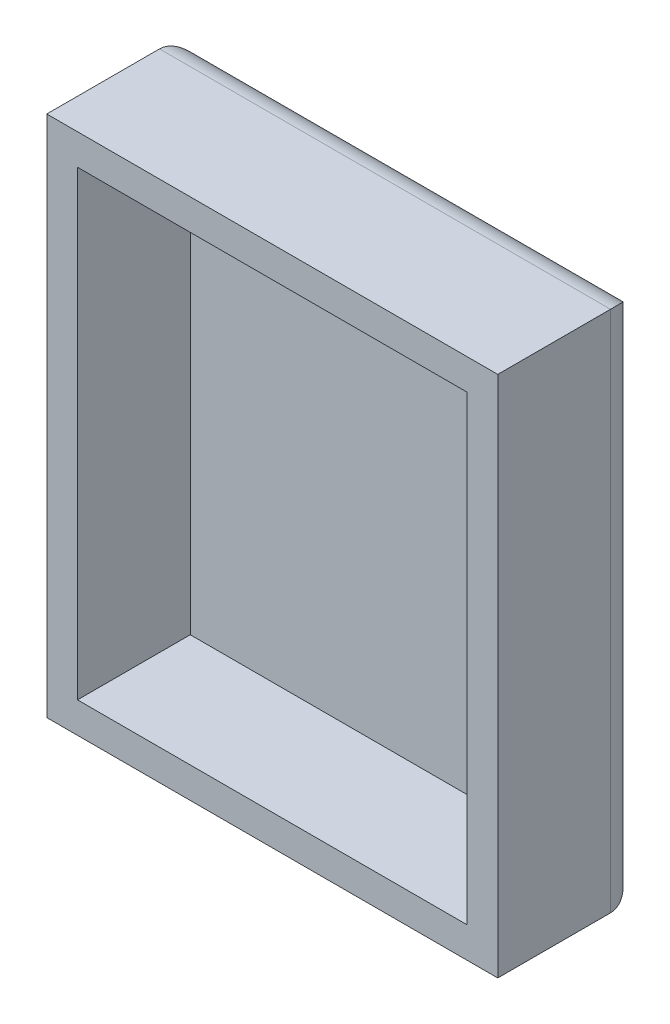
ISO-10303-21;
HEADER;
FILE_DESCRIPTION(('STEP AP214'),'2;1');
FILE_NAME('part.step','',(''),(''),'','','');
FILE_SCHEMA(('AUTOMOTIVE_DESIGN { 1 0 10303 214 1 1 1 1 }'));
ENDSEC;
DATA;
#1=APPLICATION_CONTEXT('core data for automotive mechanical design processes');
#2=APPLICATION_PROTOCOL_DEFINITION('international standard','automotive_design',2000,#1);
#3=PRODUCT_CONTEXT('',#1,'mechanical');
#4=PRODUCT('Part','Part','',(#3));
#5=PRODUCT_RELATED_PRODUCT_CATEGORY('part','',(#4));
#6=PRODUCT_DEFINITION_FORMATION('','',#4);
#7=PRODUCT_DEFINITION_CONTEXT('part definition',#1,'design');
#8=PRODUCT_DEFINITION('design','',#6,#7);
#9=PRODUCT_DEFINITION_SHAPE('','',#8);
#10=(LENGTH_UNIT() NAMED_UNIT(*) SI_UNIT(.MILLI.,.METRE.));
#11=(NAMED_UNIT(*) PLANE_ANGLE_UNIT() SI_UNIT($,.RADIAN.));
#12=(NAMED_UNIT(*) SI_UNIT($,.STERADIAN.) SOLID_ANGLE_UNIT());
#13=UNCERTAINTY_MEASURE_WITH_UNIT(LENGTH_MEASURE(1.E-05),#10,'distance_accuracy_value','');
#14=(GEOMETRIC_REPRESENTATION_CONTEXT(3) GLOBAL_UNCERTAINTY_ASSIGNED_CONTEXT((#13)) GLOBAL_UNIT_ASSIGNED_CONTEXT((#10,
#11,#12)) REPRESENTATION_CONTEXT('',''));
#15=CARTESIAN_POINT('',(0.,0.,0.));
#16=DIRECTION('',(0.,0.,1.));
#17=DIRECTION('',(1.,0.,0.));
#18=AXIS2_PLACEMENT_3D('',#15,#16,#17);
#19=CARTESIAN_POINT('',(-59.7768767221488,24.8877551020408,14.));
#20=DIRECTION('',(1.,0.,0.));
#21=DIRECTION('',(0.,1.,0.));
#22=AXIS2_PLACEMENT_3D('',#19,#20,#21);
#23=PLANE('',#22);
#24=DIRECTION('',(0.,0.,-1.));
#25=VECTOR('',#24,1.);
#26=CARTESIAN_POINT('',(-59.7768767221488,24.8877551020408,14.));
#27=LINE('',#26,#25);
#28=CARTESIAN_POINT('',(-59.7768767221488,24.8877551020408,14.));
#29=VERTEX_POINT('',#28);
#30=CARTESIAN_POINT('',(-59.7768767221488,24.8877551020408,3.));
#31=VERTEX_POINT('',#30);
#32=EDGE_CURVE('E186',#29,#31,#27,.T.);
#33=ORIENTED_EDGE('',*,*,#32,.T.);
#34=DIRECTION('',(0.,-1.,0.));
#35=VECTOR('',#34,1.);
#36=CARTESIAN_POINT('',(-59.7768767221488,24.8877551020408,3.));
#37=LINE('',#36,#35);
#38=CARTESIAN_POINT('',(-59.7768767221488,-26.1122448979592,3.));
#39=VERTEX_POINT('',#38);
#40=EDGE_CURVE('E11',#31,#39,#37,.T.);
#41=ORIENTED_EDGE('',*,*,#40,.T.);
#42=DIRECTION('',(0.,0.,-1.));
#43=VECTOR('',#42,1.);
#44=CARTESIAN_POINT('',(-59.7768767221488,-26.1122448979592,14.));
#45=LINE('',#44,#43);
#46=CARTESIAN_POINT('',(-59.7768767221488,-26.1122448979592,14.));
#47=VERTEX_POINT('',#46);
#48=EDGE_CURVE('E196',#47,#39,#45,.T.);
#49=ORIENTED_EDGE('',*,*,#48,.F.);
#50=DIRECTION('',(0.,-1.,0.));
#51=VECTOR('',#50,1.);
#52=CARTESIAN_POINT('',(-59.7768767221488,24.8877551020408,14.));
#53=LINE('',#52,#51);
#54=EDGE_CURVE('E168',#29,#47,#53,.T.);
#55=ORIENTED_EDGE('',*,*,#54,.F.);
#56=EDGE_LOOP('',(#33,#41,#49,#55));
#57=FACE_BOUND('',#56,.T.);
#58=ADVANCED_FACE('F39',(#57),#23,.F.);
#59=CARTESIAN_POINT('',(-59.7768767221488,-26.1122448979592,14.));
#60=DIRECTION('',(0.,1.,0.));
#61=DIRECTION('',(0.,0.,1.));
#62=AXIS2_PLACEMENT_3D('',#59,#60,#61);
#63=PLANE('',#62);
#64=ORIENTED_EDGE('',*,*,#48,.T.);
#65=DIRECTION('',(1.,0.,0.));
#66=VECTOR('',#65,1.);
#67=CARTESIAN_POINT('',(-59.7768767221488,-26.1122448979592,3.));
#68=LINE('',#67,#66);
#69=CARTESIAN_POINT('',(-15.7768767221488,-26.1122448979592,3.));
#70=VERTEX_POINT('',#69);
#71=EDGE_CURVE('E49',#39,#70,#68,.T.);
#72=ORIENTED_EDGE('',*,*,#71,.T.);
#73=DIRECTION('',(0.,0.,-1.));
#74=VECTOR('',#73,1.);
#75=CARTESIAN_POINT('',(-15.7768767221488,-26.1122448979592,14.));
#76=LINE('',#75,#74);
#77=CARTESIAN_POINT('',(-15.7768767221488,-26.1122448979592,14.));
#78=VERTEX_POINT('',#77);
#79=EDGE_CURVE('E193',#78,#70,#76,.T.);
#80=ORIENTED_EDGE('',*,*,#79,.F.);
#81=DIRECTION('',(1.,0.,0.));
#82=VECTOR('',#81,1.);
#83=CARTESIAN_POINT('',(-59.7768767221488,-26.1122448979592,14.));
#84=LINE('',#83,#82);
#85=EDGE_CURVE('E177',#47,#78,#84,.T.);
#86=ORIENTED_EDGE('',*,*,#85,.F.);
#87=EDGE_LOOP('',(#64,#72,#80,#86));
#88=FACE_BOUND('',#87,.T.);
#89=ADVANCED_FACE('F261',(#88),#63,.F.);
#90=CARTESIAN_POINT('',(-15.7768767221488,24.8877551020408,14.));
#91=DIRECTION('',(-1.,0.,0.));
#92=DIRECTION('',(0.,-1.,0.));
#93=AXIS2_PLACEMENT_3D('',#90,#91,#92);
#94=PLANE('',#93);
#95=ORIENTED_EDGE('',*,*,#79,.T.);
#96=DIRECTION('',(0.,1.,0.));
#97=VECTOR('',#96,1.);
#98=CARTESIAN_POINT('',(-15.7768767221488,24.8877551020408,3.));
#99=LINE('',#98,#97);
#100=CARTESIAN_POINT('',(-15.7768767221488,24.8877551020408,3.));
#101=VERTEX_POINT('',#100);
#102=EDGE_CURVE('E216',#70,#101,#99,.T.);
#103=ORIENTED_EDGE('',*,*,#102,.T.);
#104=DIRECTION('',(0.,0.,-1.));
#105=VECTOR('',#104,1.);
#106=CARTESIAN_POINT('',(-15.7768767221488,24.8877551020408,14.));
#107=LINE('',#106,#105);
#108=CARTESIAN_POINT('',(-15.7768767221488,24.8877551020408,14.));
#109=VERTEX_POINT('',#108);
#110=EDGE_CURVE('E189',#109,#101,#107,.T.);
#111=ORIENTED_EDGE('',*,*,#110,.F.);
#112=DIRECTION('',(0.,1.,0.));
#113=VECTOR('',#112,1.);
#114=CARTESIAN_POINT('',(-15.7768767221488,24.8877551020408,14.));
#115=LINE('',#114,#113);
#116=EDGE_CURVE('E180',#78,#109,#115,.T.);
#117=ORIENTED_EDGE('',*,*,#116,.F.);
#118=EDGE_LOOP('',(#95,#103,#111,#117));
#119=FACE_BOUND('',#118,.T.);
#120=ADVANCED_FACE('F260',(#119),#94,.F.);
#121=CARTESIAN_POINT('',(-59.7768767221488,24.8877551020408,14.));
#122=DIRECTION('',(0.,-1.,0.));
#123=DIRECTION('',(0.,0.,-1.));
#124=AXIS2_PLACEMENT_3D('',#121,#122,#123);
#125=PLANE('',#124);
#126=ORIENTED_EDGE('',*,*,#110,.T.);
#127=DIRECTION('',(-1.,0.,0.));
#128=VECTOR('',#127,1.);
#129=CARTESIAN_POINT('',(-59.7768767221488,24.8877551020408,3.));
#130=LINE('',#129,#128);
#131=EDGE_CURVE('E199',#101,#31,#130,.T.);
#132=ORIENTED_EDGE('',*,*,#131,.T.);
#133=ORIENTED_EDGE('',*,*,#32,.F.);
#134=DIRECTION('',(-1.,0.,0.));
#135=VECTOR('',#134,1.);
#136=CARTESIAN_POINT('',(-59.7768767221488,24.8877551020408,14.));
#137=LINE('',#136,#135);
#138=EDGE_CURVE('E183',#109,#29,#137,.T.);
#139=ORIENTED_EDGE('',*,*,#138,.F.);
#140=EDGE_LOOP('',(#126,#132,#133,#139));
#141=FACE_BOUND('',#140,.T.);
#142=ADVANCED_FACE('F252',(#141),#125,.F.);
#143=CARTESIAN_POINT('',(0.,0.,14.));
#144=DIRECTION('',(0.,0.,1.));
#145=DIRECTION('',(1.,0.,0.));
#146=AXIS2_PLACEMENT_3D('',#143,#144,#145);
#147=PLANE('',#146);
#148=DIRECTION('',(0.,-1.,0.));
#149=VECTOR('',#148,1.);
#150=CARTESIAN_POINT('',(-56.7768767221488,21.8877551020408,14.));
#151=LINE('',#150,#149);
#152=CARTESIAN_POINT('',(-56.7768767221488,21.8877551020408,14.));
#153=VERTEX_POINT('',#152);
#154=CARTESIAN_POINT('',(-56.7768767221488,-23.1122448979592,14.));
#155=VERTEX_POINT('',#154);
#156=EDGE_CURVE('E126',#153,#155,#151,.T.);
#157=ORIENTED_EDGE('',*,*,#156,.F.);
#158=DIRECTION('',(-1.,0.,0.));
#159=VECTOR('',#158,1.);
#160=CARTESIAN_POINT('',(-56.7768767221488,21.8877551020408,14.));
#161=LINE('',#160,#159);
#162=CARTESIAN_POINT('',(-18.7768767221488,21.8877551020408,14.));
#163=VERTEX_POINT('',#162);
#164=EDGE_CURVE('E146',#163,#153,#161,.T.);
#165=ORIENTED_EDGE('',*,*,#164,.F.);
#166=DIRECTION('',(0.,1.,0.));
#167=VECTOR('',#166,1.);
#168=CARTESIAN_POINT('',(-18.7768767221488,21.8877551020408,14.));
#169=LINE('',#168,#167);
#170=CARTESIAN_POINT('',(-18.7768767221487,-23.1122448979592,14.));
#171=VERTEX_POINT('',#170);
#172=EDGE_CURVE('E150',#171,#163,#169,.T.);
#173=ORIENTED_EDGE('',*,*,#172,.F.);
#174=DIRECTION('',(1.,0.,0.));
#175=VECTOR('',#174,1.);
#176=CARTESIAN_POINT('',(-56.7768767221488,-23.1122448979592,14.));
#177=LINE('',#176,#175);
#178=EDGE_CURVE('E159',#155,#171,#177,.T.);
#179=ORIENTED_EDGE('',*,*,#178,.F.);
#180=EDGE_LOOP('',(#157,#165,#173,#179));
#181=FACE_BOUND('',#180,.T.);
#182=ORIENTED_EDGE('',*,*,#54,.T.);
#183=ORIENTED_EDGE('',*,*,#85,.T.);
#184=ORIENTED_EDGE('',*,*,#116,.T.);
#185=ORIENTED_EDGE('',*,*,#138,.T.);
#186=EDGE_LOOP('',(#182,#183,#184,#185));
#187=FACE_BOUND('',#186,.T.);
#188=ADVANCED_FACE('F257',(#181,#187),#147,.T.);
#189=CARTESIAN_POINT('',(0.,0.,0.));
#190=DIRECTION('',(0.,0.,1.));
#191=DIRECTION('',(1.,0.,0.));
#192=AXIS2_PLACEMENT_3D('',#189,#190,#191);
#193=PLANE('',#192);
#194=DIRECTION('',(0.,-1.,0.));
#195=VECTOR('',#194,1.);
#196=CARTESIAN_POINT('',(-56.7768767221488,0.,0.));
#197=LINE('',#196,#195);
#198=CARTESIAN_POINT('',(-56.7768767221488,-23.1122448979592,0.));
#199=VERTEX_POINT('',#198);
#200=CARTESIAN_POINT('',(-56.7768767221488,21.8877551020408,0.));
#201=VERTEX_POINT('',#200);
#202=EDGE_CURVE('E203',#199,#201,#197,.F.);
#203=ORIENTED_EDGE('',*,*,#202,.T.);
#204=DIRECTION('',(-1.,0.,0.));
#205=VECTOR('',#204,1.);
#206=CARTESIAN_POINT('',(0.,21.8877551020408,0.));
#207=LINE('',#206,#205);
#208=CARTESIAN_POINT('',(-18.7768767221488,21.8877551020408,0.));
#209=VERTEX_POINT('',#208);
#210=EDGE_CURVE('E212',#201,#209,#207,.F.);
#211=ORIENTED_EDGE('',*,*,#210,.T.);
#212=DIRECTION('',(0.,1.,0.));
#213=VECTOR('',#212,1.);
#214=CARTESIAN_POINT('',(-18.7768767221488,0.,0.));
#215=LINE('',#214,#213);
#216=CARTESIAN_POINT('',(-18.7768767221488,-23.1122448979592,0.));
#217=VERTEX_POINT('',#216);
#218=EDGE_CURVE('E209',#209,#217,#215,.F.);
#219=ORIENTED_EDGE('',*,*,#218,.T.);
#220=DIRECTION('',(1.,0.,0.));
#221=VECTOR('',#220,1.);
#222=CARTESIAN_POINT('',(0.,-23.1122448979592,0.));
#223=LINE('',#222,#221);
#224=EDGE_CURVE('E206',#217,#199,#223,.F.);
#225=ORIENTED_EDGE('',*,*,#224,.T.);
#226=EDGE_LOOP('',(#203,#211,#219,#225));
#227=FACE_BOUND('',#226,.T.);
#228=ADVANCED_FACE('F243',(#227),#193,.F.);
#229=CARTESIAN_POINT('',(-56.7768767221488,21.8877551020408,3.));
#230=DIRECTION('',(-1.,0.,0.));
#231=DIRECTION('',(0.,-1.,0.));
#232=AXIS2_PLACEMENT_3D('',#229,#230,#231);
#233=PLANE('',#232);
#234=ORIENTED_EDGE('',*,*,#156,.T.);
#235=DIRECTION('',(0.,0.,1.));
#236=VECTOR('',#235,1.);
#237=CARTESIAN_POINT('',(-56.7768767221488,-23.1122448979592,3.));
#238=LINE('',#237,#236);
#239=CARTESIAN_POINT('',(-56.7768767221488,-23.1122448979592,3.));
#240=VERTEX_POINT('',#239);
#241=EDGE_CURVE('E119',#240,#155,#238,.T.);
#242=ORIENTED_EDGE('',*,*,#241,.F.);
#243=DIRECTION('',(0.,-1.,0.));
#244=VECTOR('',#243,1.);
#245=CARTESIAN_POINT('',(-56.7768767221488,21.8877551020408,3.));
#246=LINE('',#245,#244);
#247=CARTESIAN_POINT('',(-56.7768767221488,21.8877551020408,3.));
#248=VERTEX_POINT('',#247);
#249=EDGE_CURVE('E123',#248,#240,#246,.T.);
#250=ORIENTED_EDGE('',*,*,#249,.F.);
#251=DIRECTION('',(0.,0.,1.));
#252=VECTOR('',#251,1.);
#253=CARTESIAN_POINT('',(-56.7768767221488,21.8877551020408,3.));
#254=LINE('',#253,#252);
#255=EDGE_CURVE('E165',#248,#153,#254,.T.);
#256=ORIENTED_EDGE('',*,*,#255,.T.);
#257=EDGE_LOOP('',(#234,#242,#250,#256));
#258=FACE_BOUND('',#257,.T.);
#259=ADVANCED_FACE('F121',(#258),#233,.F.);
#260=CARTESIAN_POINT('',(-56.7768767221488,21.8877551020408,3.));
#261=DIRECTION('',(0.,1.,0.));
#262=DIRECTION('',(0.,0.,1.));
#263=AXIS2_PLACEMENT_3D('',#260,#261,#262);
#264=PLANE('',#263);
#265=ORIENTED_EDGE('',*,*,#164,.T.);
#266=ORIENTED_EDGE('',*,*,#255,.F.);
#267=DIRECTION('',(-1.,0.,0.));
#268=VECTOR('',#267,1.);
#269=CARTESIAN_POINT('',(-56.7768767221488,21.8877551020408,3.));
#270=LINE('',#269,#268);
#271=CARTESIAN_POINT('',(-18.7768767221488,21.8877551020408,3.));
#272=VERTEX_POINT('',#271);
#273=EDGE_CURVE('E132',#272,#248,#270,.T.);
#274=ORIENTED_EDGE('',*,*,#273,.F.);
#275=DIRECTION('',(0.,0.,1.));
#276=VECTOR('',#275,1.);
#277=CARTESIAN_POINT('',(-18.7768767221488,21.8877551020408,3.));
#278=LINE('',#277,#276);
#279=EDGE_CURVE('E169',#272,#163,#278,.T.);
#280=ORIENTED_EDGE('',*,*,#279,.T.);
#281=EDGE_LOOP('',(#265,#266,#274,#280));
#282=FACE_BOUND('',#281,.T.);
#283=ADVANCED_FACE('F289',(#282),#264,.F.);
#284=CARTESIAN_POINT('',(-18.7768767221488,21.8877551020408,3.));
#285=DIRECTION('',(1.,0.,0.));
#286=DIRECTION('',(0.,1.,0.));
#287=AXIS2_PLACEMENT_3D('',#284,#285,#286);
#288=PLANE('',#287);
#289=ORIENTED_EDGE('',*,*,#172,.T.);
#290=ORIENTED_EDGE('',*,*,#279,.F.);
#291=DIRECTION('',(0.,1.,0.));
#292=VECTOR('',#291,1.);
#293=CARTESIAN_POINT('',(-18.7768767221488,21.8877551020408,3.));
#294=LINE('',#293,#292);
#295=CARTESIAN_POINT('',(-18.7768767221487,-23.1122448979592,3.));
#296=VERTEX_POINT('',#295);
#297=EDGE_CURVE('E141',#296,#272,#294,.T.);
#298=ORIENTED_EDGE('',*,*,#297,.F.);
#299=DIRECTION('',(0.,0.,1.));
#300=VECTOR('',#299,1.);
#301=CARTESIAN_POINT('',(-18.7768767221487,-23.1122448979592,3.));
#302=LINE('',#301,#300);
#303=EDGE_CURVE('E131',#296,#171,#302,.T.);
#304=ORIENTED_EDGE('',*,*,#303,.T.);
#305=EDGE_LOOP('',(#289,#290,#298,#304));
#306=FACE_BOUND('',#305,.T.);
#307=ADVANCED_FACE('F286',(#306),#288,.F.);
#308=CARTESIAN_POINT('',(-56.7768767221488,-23.1122448979592,3.));
#309=DIRECTION('',(0.,-1.,0.));
#310=DIRECTION('',(0.,0.,-1.));
#311=AXIS2_PLACEMENT_3D('',#308,#309,#310);
#312=PLANE('',#311);
#313=ORIENTED_EDGE('',*,*,#178,.T.);
#314=ORIENTED_EDGE('',*,*,#303,.F.);
#315=DIRECTION('',(1.,0.,0.));
#316=VECTOR('',#315,1.);
#317=CARTESIAN_POINT('',(-56.7768767221488,-23.1122448979592,3.));
#318=LINE('',#317,#316);
#319=EDGE_CURVE('E135',#240,#296,#318,.T.);
#320=ORIENTED_EDGE('',*,*,#319,.F.);
#321=ORIENTED_EDGE('',*,*,#241,.T.);
#322=EDGE_LOOP('',(#313,#314,#320,#321));
#323=FACE_BOUND('',#322,.T.);
#324=ADVANCED_FACE('F136',(#323),#312,.F.);
#325=CARTESIAN_POINT('',(0.,0.,3.));
#326=DIRECTION('',(0.,0.,1.));
#327=DIRECTION('',(1.,0.,0.));
#328=AXIS2_PLACEMENT_3D('',#325,#326,#327);
#329=PLANE('',#328);
#330=ORIENTED_EDGE('',*,*,#249,.T.);
#331=ORIENTED_EDGE('',*,*,#319,.T.);
#332=ORIENTED_EDGE('',*,*,#297,.T.);
#333=ORIENTED_EDGE('',*,*,#273,.T.);
#334=EDGE_LOOP('',(#330,#331,#332,#333));
#335=FACE_BOUND('',#334,.T.);
#336=ADVANCED_FACE('F143',(#335),#329,.T.);
#337=CARTESIAN_POINT('',(-59.7768767221488,-23.1122448979592,3.));
#338=DIRECTION('',(1.,0.,0.));
#339=DIRECTION('',(0.,0.,-1.));
#340=AXIS2_PLACEMENT_3D('',#337,#338,#339);
#341=CYLINDRICAL_SURFACE('',#340,3.);
#342=CARTESIAN_POINT('',(-56.7768767221488,-23.1122448979592,3.));
#343=DIRECTION('',(0.707106781186548,-0.707106781186547,0.));
#344=DIRECTION('',(-0.707106781186547,-0.707106781186548,0.));
#345=AXIS2_PLACEMENT_3D('',#342,#343,#344);
#346=ELLIPSE('',#345,4.24264068711928,3.);
#347=EDGE_CURVE('E226',#199,#39,#346,.F.);
#348=ORIENTED_EDGE('',*,*,#347,.F.);
#349=ORIENTED_EDGE('',*,*,#224,.F.);
#350=CARTESIAN_POINT('',(-18.7768767221488,-23.1122448979592,3.));
#351=DIRECTION('',(0.707106781186547,0.707106781186548,0.));
#352=DIRECTION('',(0.707106781186548,-0.707106781186547,0.));
#353=AXIS2_PLACEMENT_3D('',#350,#351,#352);
#354=ELLIPSE('',#353,4.24264068711929,3.);
#355=EDGE_CURVE('E43',#70,#217,#354,.T.);
#356=ORIENTED_EDGE('',*,*,#355,.F.);
#357=ORIENTED_EDGE('',*,*,#71,.F.);
#358=EDGE_LOOP('',(#348,#349,#356,#357));
#359=FACE_BOUND('',#358,.T.);
#360=ADVANCED_FACE('F41',(#359),#341,.T.);
#361=CARTESIAN_POINT('',(-18.7768767221488,24.8877551020408,3.));
#362=DIRECTION('',(0.,1.,0.));
#363=DIRECTION('',(-1.,0.,0.));
#364=AXIS2_PLACEMENT_3D('',#361,#362,#363);
#365=CYLINDRICAL_SURFACE('',#364,3.);
#366=ORIENTED_EDGE('',*,*,#355,.T.);
#367=ORIENTED_EDGE('',*,*,#218,.F.);
#368=CARTESIAN_POINT('',(-18.7768767221488,21.8877551020408,3.));
#369=DIRECTION('',(-0.707106781186548,0.707106781186547,0.));
#370=DIRECTION('',(0.707106781186547,0.707106781186548,0.));
#371=AXIS2_PLACEMENT_3D('',#368,#369,#370);
#372=ELLIPSE('',#371,4.24264068711928,3.);
#373=EDGE_CURVE('E224',#101,#209,#372,.T.);
#374=ORIENTED_EDGE('',*,*,#373,.F.);
#375=ORIENTED_EDGE('',*,*,#102,.F.);
#376=EDGE_LOOP('',(#366,#367,#374,#375));
#377=FACE_BOUND('',#376,.T.);
#378=ADVANCED_FACE('F238',(#377),#365,.T.);
#379=CARTESIAN_POINT('',(-56.7768767221488,24.8877551020408,3.));
#380=DIRECTION('',(0.,-1.,0.));
#381=DIRECTION('',(1.,0.,0.));
#382=AXIS2_PLACEMENT_3D('',#379,#380,#381);
#383=CYLINDRICAL_SURFACE('',#382,3.);
#384=ORIENTED_EDGE('',*,*,#347,.T.);
#385=ORIENTED_EDGE('',*,*,#40,.F.);
#386=CARTESIAN_POINT('',(-56.7768767221488,21.8877551020408,3.));
#387=DIRECTION('',(-0.707106781186547,-0.707106781186548,0.));
#388=DIRECTION('',(0.707106781186548,-0.707106781186547,0.));
#389=AXIS2_PLACEMENT_3D('',#386,#387,#388);
#390=ELLIPSE('',#389,4.24264068711929,3.);
#391=EDGE_CURVE('E221',#201,#31,#390,.F.);
#392=ORIENTED_EDGE('',*,*,#391,.F.);
#393=ORIENTED_EDGE('',*,*,#202,.F.);
#394=EDGE_LOOP('',(#384,#385,#392,#393));
#395=FACE_BOUND('',#394,.T.);
#396=ADVANCED_FACE('F249',(#395),#383,.T.);
#397=CARTESIAN_POINT('',(-59.7768767221488,21.8877551020408,3.));
#398=DIRECTION('',(-1.,0.,0.));
#399=DIRECTION('',(0.,0.,1.));
#400=AXIS2_PLACEMENT_3D('',#397,#398,#399);
#401=CYLINDRICAL_SURFACE('',#400,3.);
#402=ORIENTED_EDGE('',*,*,#373,.T.);
#403=ORIENTED_EDGE('',*,*,#210,.F.);
#404=ORIENTED_EDGE('',*,*,#391,.T.);
#405=ORIENTED_EDGE('',*,*,#131,.F.);
#406=EDGE_LOOP('',(#402,#403,#404,#405));
#407=FACE_BOUND('',#406,.T.);
#408=ADVANCED_FACE('F247',(#407),#401,.T.);
#409=CLOSED_SHELL('',(#58,#89,#120,#142,#188,#228,#259,#283,#307,#324,#336,#360,#378,#396,#408));
#410=MANIFOLD_SOLID_BREP('B2',#409);
#411=ADVANCED_BREP_SHAPE_REPRESENTATION('',(#18,#410),#14);
#412=SHAPE_DEFINITION_REPRESENTATION(#9,#411);
ENDSEC;
END-ISO-10303-21;
